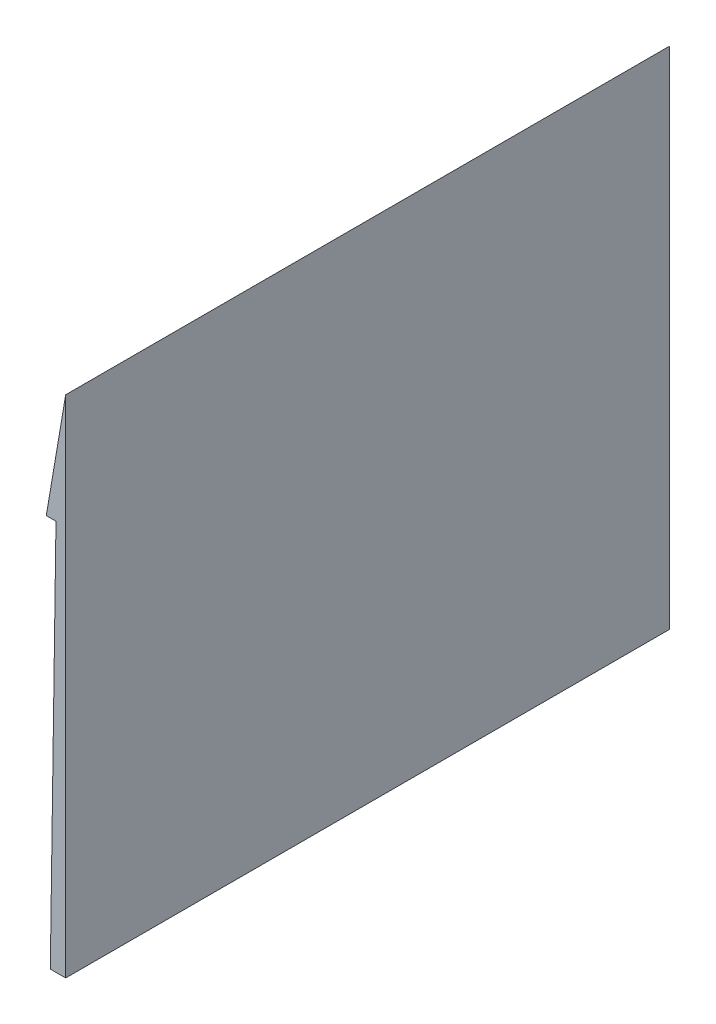
ISO-10303-21;
HEADER;
FILE_DESCRIPTION(('STEP AP214'),'2;1');
FILE_NAME('part.step','',(''),(''),'','','');
FILE_SCHEMA(('AUTOMOTIVE_DESIGN { 1 0 10303 214 1 1 1 1 }'));
ENDSEC;
DATA;
#1=APPLICATION_CONTEXT('core data for automotive mechanical design processes');
#2=APPLICATION_PROTOCOL_DEFINITION('international standard','automotive_design',2000,#1);
#3=PRODUCT_CONTEXT('',#1,'mechanical');
#4=PRODUCT('Part','Part','',(#3));
#5=PRODUCT_RELATED_PRODUCT_CATEGORY('part','',(#4));
#6=PRODUCT_DEFINITION_FORMATION('','',#4);
#7=PRODUCT_DEFINITION_CONTEXT('part definition',#1,'design');
#8=PRODUCT_DEFINITION('design','',#6,#7);
#9=PRODUCT_DEFINITION_SHAPE('','',#8);
#10=(LENGTH_UNIT() NAMED_UNIT(*) SI_UNIT(.MILLI.,.METRE.));
#11=(NAMED_UNIT(*) PLANE_ANGLE_UNIT() SI_UNIT($,.RADIAN.));
#12=(NAMED_UNIT(*) SI_UNIT($,.STERADIAN.) SOLID_ANGLE_UNIT());
#13=UNCERTAINTY_MEASURE_WITH_UNIT(LENGTH_MEASURE(1.E-05),#10,'distance_accuracy_value','');
#14=(GEOMETRIC_REPRESENTATION_CONTEXT(3) GLOBAL_UNCERTAINTY_ASSIGNED_CONTEXT((#13)) GLOBAL_UNIT_ASSIGNED_CONTEXT((#10,
#11,#12)) REPRESENTATION_CONTEXT('',''));
#15=CARTESIAN_POINT('',(0.,0.,0.));
#16=DIRECTION('',(0.,0.,1.));
#17=DIRECTION('',(1.,0.,0.));
#18=AXIS2_PLACEMENT_3D('',#15,#16,#17);
#19=CARTESIAN_POINT('',(0.,26.22867164,50.));
#20=DIRECTION('',(0.98589540581115,-0.167362626653825,0.));
#21=DIRECTION('',(0.167362626653825,0.98589540581115,0.));
#22=AXIS2_PLACEMENT_3D('',#19,#20,#21);
#23=PLANE('',#22);
#24=DIRECTION('',(-0.167362626653825,-0.98589540581115,0.));
#25=VECTOR('',#24,1.);
#26=CARTESIAN_POINT('',(0.,26.22867164,-50.));
#27=LINE('',#26,#25);
#28=CARTESIAN_POINT('',(0.,26.22867164,-50.));
#29=VERTEX_POINT('',#28);
#30=CARTESIAN_POINT('',(-3.21519720057467,7.28867164,-50.));
#31=VERTEX_POINT('',#30);
#32=EDGE_CURVE('E110',#29,#31,#27,.T.);
#33=ORIENTED_EDGE('',*,*,#32,.T.);
#34=DIRECTION('',(0.,0.,-1.));
#35=VECTOR('',#34,1.);
#36=CARTESIAN_POINT('',(-3.21519720057467,7.28867164,50.));
#37=LINE('',#36,#35);
#38=CARTESIAN_POINT('',(-3.21519720057467,7.28867164,50.));
#39=VERTEX_POINT('',#38);
#40=EDGE_CURVE('E11',#39,#31,#37,.T.);
#41=ORIENTED_EDGE('',*,*,#40,.F.);
#42=DIRECTION('',(-0.167362626653825,-0.98589540581115,0.));
#43=VECTOR('',#42,1.);
#44=CARTESIAN_POINT('',(0.,26.22867164,50.));
#45=LINE('',#44,#43);
#46=CARTESIAN_POINT('',(0.,26.22867164,50.));
#47=VERTEX_POINT('',#46);
#48=EDGE_CURVE('E119',#47,#39,#45,.T.);
#49=ORIENTED_EDGE('',*,*,#48,.F.);
#50=DIRECTION('',(0.,0.,-1.));
#51=VECTOR('',#50,1.);
#52=CARTESIAN_POINT('',(0.,26.22867164,50.));
#53=LINE('',#52,#51);
#54=EDGE_CURVE('E106',#47,#29,#53,.T.);
#55=ORIENTED_EDGE('',*,*,#54,.T.);
#56=EDGE_LOOP('',(#33,#41,#49,#55));
#57=FACE_BOUND('',#56,.T.);
#58=ADVANCED_FACE('F35',(#57),#23,.F.);
#59=CARTESIAN_POINT('',(-3.21519720057467,7.28867164,50.));
#60=DIRECTION('',(0.,1.,0.));
#61=DIRECTION('',(0.,0.,1.));
#62=AXIS2_PLACEMENT_3D('',#59,#60,#61);
#63=PLANE('',#62);
#64=DIRECTION('',(1.,0.,0.));
#65=VECTOR('',#64,1.);
#66=CARTESIAN_POINT('',(-3.21519720057467,7.28867164,-50.));
#67=LINE('',#66,#65);
#68=CARTESIAN_POINT('',(-1.60759860028733,7.28867164,-50.));
#69=VERTEX_POINT('',#68);
#70=EDGE_CURVE('E113',#31,#69,#67,.T.);
#71=ORIENTED_EDGE('',*,*,#70,.T.);
#72=DIRECTION('',(0.,0.,-1.));
#73=VECTOR('',#72,1.);
#74=CARTESIAN_POINT('',(-1.60759860028733,7.28867164,50.));
#75=LINE('',#74,#73);
#76=CARTESIAN_POINT('',(-1.60759860028733,7.28867164,50.));
#77=VERTEX_POINT('',#76);
#78=EDGE_CURVE('E43',#77,#69,#75,.T.);
#79=ORIENTED_EDGE('',*,*,#78,.F.);
#80=DIRECTION('',(1.,0.,0.));
#81=VECTOR('',#80,1.);
#82=CARTESIAN_POINT('',(-3.21519720057467,7.28867164,50.));
#83=LINE('',#82,#81);
#84=EDGE_CURVE('E83',#39,#77,#83,.T.);
#85=ORIENTED_EDGE('',*,*,#84,.F.);
#86=ORIENTED_EDGE('',*,*,#40,.T.);
#87=EDGE_LOOP('',(#71,#79,#85,#86));
#88=FACE_BOUND('',#87,.T.);
#89=ADVANCED_FACE('F127',(#88),#63,.F.);
#90=CARTESIAN_POINT('',(-2.54836798607962,-57.3960449638946,50.));
#91=DIRECTION('',(0.999894253961712,-0.0145423826916814,0.));
#92=DIRECTION('',(0.0145423826916814,0.999894253961712,0.));
#93=AXIS2_PLACEMENT_3D('',#90,#91,#92);
#94=PLANE('',#93);
#95=DIRECTION('',(-0.0145423826916814,-0.999894253961712,0.));
#96=VECTOR('',#95,1.);
#97=CARTESIAN_POINT('',(-2.54836798607962,-57.3960449638946,-50.));
#98=LINE('',#97,#96);
#99=CARTESIAN_POINT('',(-2.54836798607962,-57.3960449638946,-50.));
#100=VERTEX_POINT('',#99);
#101=EDGE_CURVE('E100',#69,#100,#98,.T.);
#102=ORIENTED_EDGE('',*,*,#101,.T.);
#103=DIRECTION('',(0.,0.,-1.));
#104=VECTOR('',#103,1.);
#105=CARTESIAN_POINT('',(-2.54836798607962,-57.3960449638946,50.));
#106=LINE('',#105,#104);
#107=CARTESIAN_POINT('',(-2.54836798607962,-57.3960449638946,50.));
#108=VERTEX_POINT('',#107);
#109=EDGE_CURVE('E97',#108,#100,#106,.T.);
#110=ORIENTED_EDGE('',*,*,#109,.F.);
#111=DIRECTION('',(-0.0145423826916814,-0.999894253961712,0.));
#112=VECTOR('',#111,1.);
#113=CARTESIAN_POINT('',(-2.54836798607962,-57.3960449638946,50.));
#114=LINE('',#113,#112);
#115=EDGE_CURVE('E87',#77,#108,#114,.T.);
#116=ORIENTED_EDGE('',*,*,#115,.F.);
#117=ORIENTED_EDGE('',*,*,#78,.T.);
#118=EDGE_LOOP('',(#102,#110,#116,#117));
#119=FACE_BOUND('',#118,.T.);
#120=ADVANCED_FACE('F98',(#119),#94,.F.);
#121=CARTESIAN_POINT('',(0.,-57.3960449638946,50.));
#122=DIRECTION('',(0.,1.,0.));
#123=DIRECTION('',(0.,0.,1.));
#124=AXIS2_PLACEMENT_3D('',#121,#122,#123);
#125=PLANE('',#124);
#126=DIRECTION('',(1.,0.,0.));
#127=VECTOR('',#126,1.);
#128=CARTESIAN_POINT('',(0.,-57.3960449638946,-50.));
#129=LINE('',#128,#127);
#130=CARTESIAN_POINT('',(0.,-57.3960449638946,-50.));
#131=VERTEX_POINT('',#130);
#132=EDGE_CURVE('E116',#100,#131,#129,.T.);
#133=ORIENTED_EDGE('',*,*,#132,.T.);
#134=DIRECTION('',(0.,0.,-1.));
#135=VECTOR('',#134,1.);
#136=CARTESIAN_POINT('',(0.,-57.3960449638946,50.));
#137=LINE('',#136,#135);
#138=CARTESIAN_POINT('',(0.,-57.3960449638946,50.));
#139=VERTEX_POINT('',#138);
#140=EDGE_CURVE('E102',#139,#131,#137,.T.);
#141=ORIENTED_EDGE('',*,*,#140,.F.);
#142=DIRECTION('',(1.,0.,0.));
#143=VECTOR('',#142,1.);
#144=CARTESIAN_POINT('',(0.,-57.3960449638946,50.));
#145=LINE('',#144,#143);
#146=EDGE_CURVE('E91',#108,#139,#145,.T.);
#147=ORIENTED_EDGE('',*,*,#146,.F.);
#148=ORIENTED_EDGE('',*,*,#109,.T.);
#149=EDGE_LOOP('',(#133,#141,#147,#148));
#150=FACE_BOUND('',#149,.T.);
#151=ADVANCED_FACE('F104',(#150),#125,.F.);
#152=CARTESIAN_POINT('',(0.,7.28867164,50.));
#153=DIRECTION('',(-1.,0.,0.));
#154=DIRECTION('',(0.,-1.,0.));
#155=AXIS2_PLACEMENT_3D('',#152,#153,#154);
#156=PLANE('',#155);
#157=DIRECTION('',(0.,1.,0.));
#158=VECTOR('',#157,1.);
#159=CARTESIAN_POINT('',(0.,7.28867164,-50.));
#160=LINE('',#159,#158);
#161=EDGE_CURVE('E71',#131,#29,#160,.T.);
#162=ORIENTED_EDGE('',*,*,#161,.T.);
#163=ORIENTED_EDGE('',*,*,#54,.F.);
#164=DIRECTION('',(0.,1.,0.));
#165=VECTOR('',#164,1.);
#166=CARTESIAN_POINT('',(0.,7.28867164,50.));
#167=LINE('',#166,#165);
#168=EDGE_CURVE('E51',#139,#47,#167,.T.);
#169=ORIENTED_EDGE('',*,*,#168,.F.);
#170=ORIENTED_EDGE('',*,*,#140,.T.);
#171=EDGE_LOOP('',(#162,#163,#169,#170));
#172=FACE_BOUND('',#171,.T.);
#173=ADVANCED_FACE('F122',(#172),#156,.F.);
#174=CARTESIAN_POINT('',(0.,0.,50.));
#175=DIRECTION('',(0.,0.,1.));
#176=DIRECTION('',(1.,0.,0.));
#177=AXIS2_PLACEMENT_3D('',#174,#175,#176);
#178=PLANE('',#177);
#179=ORIENTED_EDGE('',*,*,#48,.T.);
#180=ORIENTED_EDGE('',*,*,#84,.T.);
#181=ORIENTED_EDGE('',*,*,#115,.T.);
#182=ORIENTED_EDGE('',*,*,#146,.T.);
#183=ORIENTED_EDGE('',*,*,#168,.T.);
#184=EDGE_LOOP('',(#179,#180,#181,#182,#183));
#185=FACE_BOUND('',#184,.T.);
#186=ADVANCED_FACE('F89',(#185),#178,.T.);
#187=CARTESIAN_POINT('',(0.,0.,-50.));
#188=DIRECTION('',(0.,0.,1.));
#189=DIRECTION('',(1.,0.,0.));
#190=AXIS2_PLACEMENT_3D('',#187,#188,#189);
#191=PLANE('',#190);
#192=ORIENTED_EDGE('',*,*,#32,.F.);
#193=ORIENTED_EDGE('',*,*,#161,.F.);
#194=ORIENTED_EDGE('',*,*,#132,.F.);
#195=ORIENTED_EDGE('',*,*,#101,.F.);
#196=ORIENTED_EDGE('',*,*,#70,.F.);
#197=EDGE_LOOP('',(#192,#193,#194,#195,#196));
#198=FACE_BOUND('',#197,.T.);
#199=ADVANCED_FACE('F121',(#198),#191,.F.);
#200=CLOSED_SHELL('',(#58,#89,#120,#151,#173,#186,#199));
#201=MANIFOLD_SOLID_BREP('B2',#200);
#202=ADVANCED_BREP_SHAPE_REPRESENTATION('',(#18,#201),#14);
#203=SHAPE_DEFINITION_REPRESENTATION(#9,#202);
ENDSEC;
END-ISO-10303-21;
